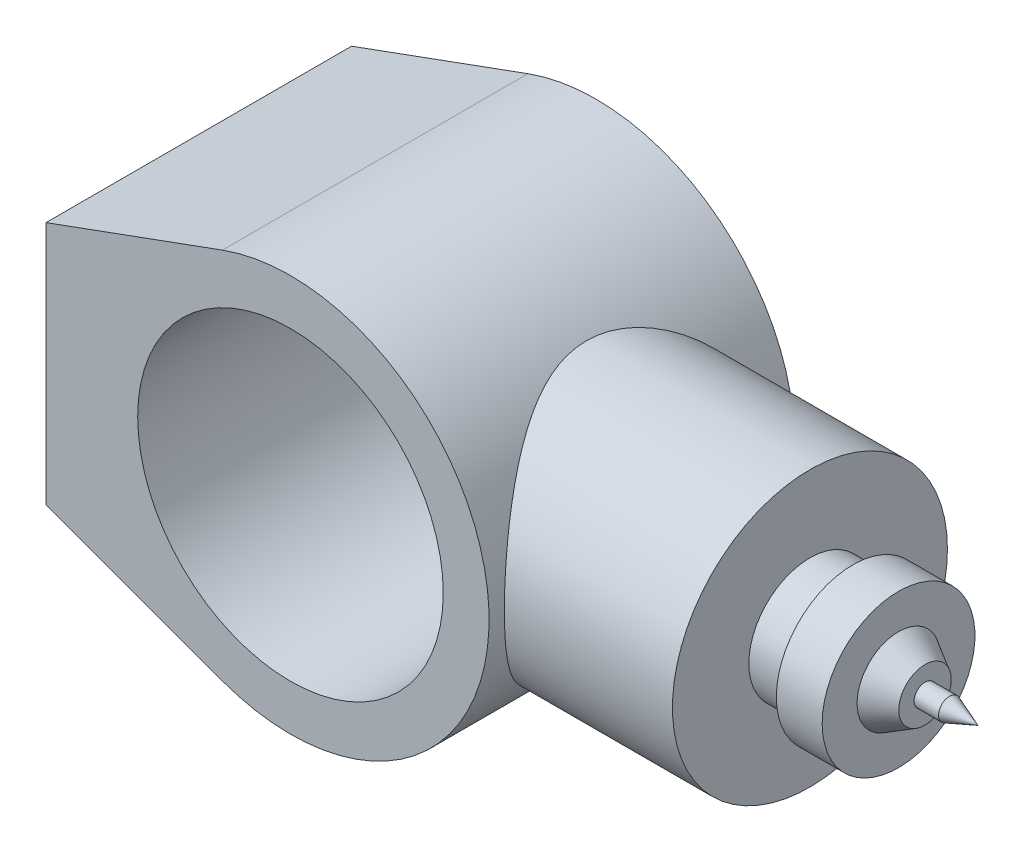
ISO-10303-21;
HEADER;
FILE_DESCRIPTION(('STEP AP214'),'2;1');
FILE_NAME('part.step','',(''),(''),'','','');
FILE_SCHEMA(('AUTOMOTIVE_DESIGN { 1 0 10303 214 1 1 1 1 }'));
ENDSEC;
DATA;
#1=APPLICATION_CONTEXT('core data for automotive mechanical design processes');
#2=APPLICATION_PROTOCOL_DEFINITION('international standard','automotive_design',2000,#1);
#3=PRODUCT_CONTEXT('',#1,'mechanical');
#4=PRODUCT('Part','Part','',(#3));
#5=PRODUCT_RELATED_PRODUCT_CATEGORY('part','',(#4));
#6=PRODUCT_DEFINITION_FORMATION('','',#4);
#7=PRODUCT_DEFINITION_CONTEXT('part definition',#1,'design');
#8=PRODUCT_DEFINITION('design','',#6,#7);
#9=PRODUCT_DEFINITION_SHAPE('','',#8);
#10=(LENGTH_UNIT() NAMED_UNIT(*) SI_UNIT(.MILLI.,.METRE.));
#11=(NAMED_UNIT(*) PLANE_ANGLE_UNIT() SI_UNIT($,.RADIAN.));
#12=(NAMED_UNIT(*) SI_UNIT($,.STERADIAN.) SOLID_ANGLE_UNIT());
#13=UNCERTAINTY_MEASURE_WITH_UNIT(LENGTH_MEASURE(1.E-05),#10,'distance_accuracy_value','');
#14=(GEOMETRIC_REPRESENTATION_CONTEXT(3) GLOBAL_UNCERTAINTY_ASSIGNED_CONTEXT((#13)) GLOBAL_UNIT_ASSIGNED_CONTEXT((#10,
#11,#12)) REPRESENTATION_CONTEXT('',''));
#15=CARTESIAN_POINT('',(0.,0.,0.));
#16=DIRECTION('',(0.,0.,1.));
#17=DIRECTION('',(1.,0.,0.));
#18=AXIS2_PLACEMENT_3D('',#15,#16,#17);
#19=CARTESIAN_POINT('',(0.,0.,50.));
#20=DIRECTION('',(0.,0.,1.));
#21=DIRECTION('',(1.,0.,0.));
#22=AXIS2_PLACEMENT_3D('',#19,#20,#21);
#23=PLANE('',#22);
#24=DIRECTION('',(-0.939410286372225,-0.342794856813887,0.));
#25=VECTOR('',#24,1.);
#26=CARTESIAN_POINT('',(-80.,40.,50.));
#27=LINE('',#26,#25);
#28=CARTESIAN_POINT('',(-22.2816656929027,61.0616686141947,50.));
#29=VERTEX_POINT('',#28);
#30=CARTESIAN_POINT('',(-80.,40.,50.));
#31=VERTEX_POINT('',#30);
#32=EDGE_CURVE('E202',#29,#31,#27,.T.);
#33=ORIENTED_EDGE('',*,*,#32,.T.);
#34=DIRECTION('',(0.,-1.,0.));
#35=VECTOR('',#34,1.);
#36=CARTESIAN_POINT('',(-80.,-40.,50.));
#37=LINE('',#36,#35);
#38=CARTESIAN_POINT('',(-80.,-40.,50.));
#39=VERTEX_POINT('',#38);
#40=EDGE_CURVE('E88',#31,#39,#37,.T.);
#41=ORIENTED_EDGE('',*,*,#40,.T.);
#42=DIRECTION('',(0.939410286372225,-0.342794856813887,0.));
#43=VECTOR('',#42,1.);
#44=CARTESIAN_POINT('',(-80.,-40.,50.));
#45=LINE('',#44,#43);
#46=CARTESIAN_POINT('',(-22.2816656929027,-61.0616686141947,50.));
#47=VERTEX_POINT('',#46);
#48=EDGE_CURVE('E195',#39,#47,#45,.T.);
#49=ORIENTED_EDGE('',*,*,#48,.T.);
#50=CARTESIAN_POINT('',(0.,0.,50.));
#51=DIRECTION('',(0.,0.,1.));
#52=DIRECTION('',(1.,0.,0.));
#53=AXIS2_PLACEMENT_3D('',#50,#51,#52);
#54=CIRCLE('',#53,65.);
#55=EDGE_CURVE('E57',#47,#29,#54,.T.);
#56=ORIENTED_EDGE('',*,*,#55,.T.);
#57=EDGE_LOOP('',(#33,#41,#49,#56));
#58=FACE_BOUND('',#57,.T.);
#59=CARTESIAN_POINT('',(0.,0.,50.));
#60=DIRECTION('',(0.,0.,1.));
#61=DIRECTION('',(1.,0.,0.));
#62=AXIS2_PLACEMENT_3D('',#59,#60,#61);
#63=CIRCLE('',#62,50.);
#64=CARTESIAN_POINT('',(50.,0.,50.));
#65=VERTEX_POINT('',#64);
#66=EDGE_CURVE('E217',#65,#65,#63,.T.);
#67=ORIENTED_EDGE('',*,*,#66,.F.);
#68=EDGE_LOOP('',(#67));
#69=FACE_BOUND('',#68,.T.);
#70=ADVANCED_FACE('F39',(#58,#69),#23,.T.);
#71=CARTESIAN_POINT('',(0.,0.,-50.));
#72=DIRECTION('',(0.,0.,1.));
#73=DIRECTION('',(1.,0.,0.));
#74=AXIS2_PLACEMENT_3D('',#71,#72,#73);
#75=PLANE('',#74);
#76=DIRECTION('',(-0.939410286372225,-0.342794856813887,0.));
#77=VECTOR('',#76,1.);
#78=CARTESIAN_POINT('',(-80.,40.,-50.));
#79=LINE('',#78,#77);
#80=CARTESIAN_POINT('',(-22.2816656929027,61.0616686141947,-50.));
#81=VERTEX_POINT('',#80);
#82=CARTESIAN_POINT('',(-80.,40.,-50.));
#83=VERTEX_POINT('',#82);
#84=EDGE_CURVE('E193',#81,#83,#79,.T.);
#85=ORIENTED_EDGE('',*,*,#84,.F.);
#86=CARTESIAN_POINT('',(0.,0.,-50.));
#87=DIRECTION('',(0.,0.,1.));
#88=DIRECTION('',(1.,0.,0.));
#89=AXIS2_PLACEMENT_3D('',#86,#87,#88);
#90=CIRCLE('',#89,65.);
#91=CARTESIAN_POINT('',(-22.2816656929027,-61.0616686141947,-50.));
#92=VERTEX_POINT('',#91);
#93=EDGE_CURVE('E81',#92,#81,#90,.T.);
#94=ORIENTED_EDGE('',*,*,#93,.F.);
#95=DIRECTION('',(0.939410286372225,-0.342794856813887,0.));
#96=VECTOR('',#95,1.);
#97=CARTESIAN_POINT('',(-80.,-40.,-50.));
#98=LINE('',#97,#96);
#99=CARTESIAN_POINT('',(-80.,-40.,-50.));
#100=VERTEX_POINT('',#99);
#101=EDGE_CURVE('E75',#100,#92,#98,.T.);
#102=ORIENTED_EDGE('',*,*,#101,.F.);
#103=DIRECTION('',(0.,-1.,0.));
#104=VECTOR('',#103,1.);
#105=CARTESIAN_POINT('',(-80.,-40.,-50.));
#106=LINE('',#105,#104);
#107=EDGE_CURVE('E187',#83,#100,#106,.T.);
#108=ORIENTED_EDGE('',*,*,#107,.F.);
#109=EDGE_LOOP('',(#85,#94,#102,#108));
#110=FACE_BOUND('',#109,.T.);
#111=CARTESIAN_POINT('',(0.,0.,-50.));
#112=DIRECTION('',(0.,0.,1.));
#113=DIRECTION('',(1.,0.,0.));
#114=AXIS2_PLACEMENT_3D('',#111,#112,#113);
#115=CIRCLE('',#114,50.);
#116=CARTESIAN_POINT('',(50.,0.,-50.));
#117=VERTEX_POINT('',#116);
#118=EDGE_CURVE('E220',#117,#117,#115,.T.);
#119=ORIENTED_EDGE('',*,*,#118,.T.);
#120=EDGE_LOOP('',(#119));
#121=FACE_BOUND('',#120,.T.);
#122=ADVANCED_FACE('F167',(#110,#121),#75,.F.);
#123=CARTESIAN_POINT('',(-80.,40.,50.));
#124=DIRECTION('',(0.342794856813887,-0.939410286372225,0.));
#125=DIRECTION('',(0.939410286372225,0.342794856813887,0.));
#126=AXIS2_PLACEMENT_3D('',#123,#124,#125);
#127=PLANE('',#126);
#128=ORIENTED_EDGE('',*,*,#84,.T.);
#129=DIRECTION('',(0.,0.,-1.));
#130=VECTOR('',#129,1.);
#131=CARTESIAN_POINT('',(-80.,40.,50.));
#132=LINE('',#131,#130);
#133=EDGE_CURVE('E11',#31,#83,#132,.T.);
#134=ORIENTED_EDGE('',*,*,#133,.F.);
#135=ORIENTED_EDGE('',*,*,#32,.F.);
#136=DIRECTION('',(0.,0.,-1.));
#137=VECTOR('',#136,1.);
#138=CARTESIAN_POINT('',(-22.2816656929027,61.0616686141947,50.));
#139=LINE('',#138,#137);
#140=EDGE_CURVE('E206',#29,#81,#139,.T.);
#141=ORIENTED_EDGE('',*,*,#140,.T.);
#142=EDGE_LOOP('',(#128,#134,#135,#141));
#143=FACE_BOUND('',#142,.T.);
#144=ADVANCED_FACE('F41',(#143),#127,.F.);
#145=CARTESIAN_POINT('',(-80.,-40.,50.));
#146=DIRECTION('',(1.,0.,0.));
#147=DIRECTION('',(0.,0.,-1.));
#148=AXIS2_PLACEMENT_3D('',#145,#146,#147);
#149=PLANE('',#148);
#150=ORIENTED_EDGE('',*,*,#107,.T.);
#151=DIRECTION('',(0.,0.,-1.));
#152=VECTOR('',#151,1.);
#153=CARTESIAN_POINT('',(-80.,-40.,50.));
#154=LINE('',#153,#152);
#155=EDGE_CURVE('E49',#39,#100,#154,.T.);
#156=ORIENTED_EDGE('',*,*,#155,.F.);
#157=ORIENTED_EDGE('',*,*,#40,.F.);
#158=ORIENTED_EDGE('',*,*,#133,.T.);
#159=EDGE_LOOP('',(#150,#156,#157,#158));
#160=FACE_BOUND('',#159,.T.);
#161=ADVANCED_FACE('F181',(#160),#149,.F.);
#162=CARTESIAN_POINT('',(-80.,-40.,50.));
#163=DIRECTION('',(0.342794856813887,0.939410286372225,0.));
#164=DIRECTION('',(-0.939410286372225,0.342794856813887,0.));
#165=AXIS2_PLACEMENT_3D('',#162,#163,#164);
#166=PLANE('',#165);
#167=ORIENTED_EDGE('',*,*,#101,.T.);
#168=DIRECTION('',(0.,0.,-1.));
#169=VECTOR('',#168,1.);
#170=CARTESIAN_POINT('',(-22.2816656929027,-61.0616686141947,50.));
#171=LINE('',#170,#169);
#172=EDGE_CURVE('E197',#47,#92,#171,.T.);
#173=ORIENTED_EDGE('',*,*,#172,.F.);
#174=ORIENTED_EDGE('',*,*,#48,.F.);
#175=ORIENTED_EDGE('',*,*,#155,.T.);
#176=EDGE_LOOP('',(#167,#173,#174,#175));
#177=FACE_BOUND('',#176,.T.);
#178=ADVANCED_FACE('F178',(#177),#166,.F.);
#179=CARTESIAN_POINT('',(0.,0.,50.));
#180=DIRECTION('',(0.,0.,-1.));
#181=DIRECTION('',(-1.,0.,0.));
#182=AXIS2_PLACEMENT_3D('',#179,#180,#181);
#183=CYLINDRICAL_SURFACE('',#182,65.);
#184=CARTESIAN_POINT('',(65.,0.,-45.));
#185=CARTESIAN_POINT('',(65.0000011696057,1.12147330120565,-45.0000012025283));
#186=CARTESIAN_POINT('',(64.9709159765212,2.24292945230778,-44.9580201602482));
#187=CARTESIAN_POINT('',(64.8553068641383,4.47658414079082,-44.790785609369));
#188=CARTESIAN_POINT('',(64.7687842573088,5.58878288911931,-44.6655340035371));
#189=CARTESIAN_POINT('',(64.5403785763001,7.79555151848628,-44.3336771879691));
#190=CARTESIAN_POINT('',(64.3984760503456,8.89011506447751,-44.1270433931238));
#191=CARTESIAN_POINT('',(64.0626457436966,11.0533096019768,-43.6354760134034));
#192=CARTESIAN_POINT('',(63.8687169569864,12.1219400915896,-43.3505409144375));
#193=CARTESIAN_POINT('',(63.4342222744662,14.2212125160505,-42.7078017297046));
#194=CARTESIAN_POINT('',(63.1938918545645,15.2520162370063,-42.3503651251477));
#195=CARTESIAN_POINT('',(62.6709259446924,17.2756280115286,-41.5659763086892));
#196=CARTESIAN_POINT('',(62.3882907364915,18.268436318107,-41.1390245597888));
#197=CARTESIAN_POINT('',(61.786108553932,20.2116697228795,-40.2199419970838));
#198=CARTESIAN_POINT('',(61.4665619062631,21.1620951960855,-39.7278117601444));
#199=CARTESIAN_POINT('',(60.7962171584065,23.0172309124314,-38.6825647509799));
#200=CARTESIAN_POINT('',(60.4454175300334,23.9219389167185,-38.1294449962195));
#201=CARTESIAN_POINT('',(59.6865648974474,25.7601880140228,-36.9151737617935));
#202=CARTESIAN_POINT('',(59.27618815402,26.6893215363404,-36.2488040005491));
#203=CARTESIAN_POINT('',(58.4330275057249,28.4880338622967,-34.8529502059224));
#204=CARTESIAN_POINT('',(58.0002425478181,29.3576098626539,-34.1234632053608));
#205=CARTESIAN_POINT('',(57.1195111836477,31.0364486388513,-32.6040251352403));
#206=CARTESIAN_POINT('',(56.6715447181891,31.8456267033451,-31.8139921794123));
#207=CARTESIAN_POINT('',(55.7691986061138,33.4006700551814,-30.1773036556993));
#208=CARTESIAN_POINT('',(55.3148185876119,34.1465316534289,-29.3306447936721));
#209=CARTESIAN_POINT('',(54.3303114345595,35.6959084068904,-27.4326466159468));
#210=CARTESIAN_POINT('',(53.8005937511269,36.4872853280241,-26.3711450656527));
#211=CARTESIAN_POINT('',(52.7593327891933,37.9773509509911,-24.17604025639));
#212=CARTESIAN_POINT('',(52.2477941160227,38.6760162868262,-23.0424189272517));
#213=CARTESIAN_POINT('',(51.2608149265043,39.9749077721744,-20.7072341856928));
#214=CARTESIAN_POINT('',(50.7853275075273,40.5752630453964,-19.5057627267967));
#215=CARTESIAN_POINT('',(49.8892399163793,41.6721166930025,-17.036931864064));
#216=CARTESIAN_POINT('',(49.4686114171658,42.1686687478853,-15.7696069409943));
#217=CARTESIAN_POINT('',(48.8208029416879,42.9149535309565,-13.5723996352816));
#218=CARTESIAN_POINT('',(48.5738420263557,43.1936925213245,-12.6581208440976));
#219=CARTESIAN_POINT('',(48.1238801744123,43.6944569649788,-10.8035389223551));
#220=CARTESIAN_POINT('',(47.9208721021929,43.9164916250901,-9.86324004407419));
#221=CARTESIAN_POINT('',(47.5660754926548,44.3005296261305,-7.96250438663409));
#222=CARTESIAN_POINT('',(47.4142038087044,44.4626304606427,-7.00210302149487));
#223=CARTESIAN_POINT('',(47.1671263845177,44.7246555122386,-5.06554052628518));
#224=CARTESIAN_POINT('',(47.0719206259529,44.824579749433,-4.08937940131224));
#225=CARTESIAN_POINT('',(46.9418899090943,44.9607388198673,-2.1232364847967));
#226=CARTESIAN_POINT('',(46.9073939345417,44.9966266570423,-1.13320851844658));
#227=CARTESIAN_POINT('',(46.9013571135476,45.0029190462422,0.847248377093852));
#228=CARTESIAN_POINT('',(46.9298161498631,44.9733237202183,1.837677305534));
#229=CARTESIAN_POINT('',(47.0484302849821,44.8492190899201,3.81128752429081));
#230=CARTESIAN_POINT('',(47.13862305521,44.7546701492421,4.79446401850661));
#231=CARTESIAN_POINT('',(47.3768313176079,44.5024241630868,6.74551496467455));
#232=CARTESIAN_POINT('',(47.5248480621437,44.3447257499009,7.71338908473168));
#233=CARTESIAN_POINT('',(47.8621764271841,43.9803320764262,9.56919366964684));
#234=CARTESIAN_POINT('',(48.0484149088864,43.7772163066585,10.4583970625519));
#235=CARTESIAN_POINT('',(48.4609441046406,43.32010640119,12.2144143492181));
#236=CARTESIAN_POINT('',(48.6872496045115,43.0660934784815,13.0812198417583));
#237=CARTESIAN_POINT('',(49.1738509640383,42.5096331932465,14.7898225666927));
#238=CARTESIAN_POINT('',(49.4341648638834,42.2071601049958,15.6316062329481));
#239=CARTESIAN_POINT('',(49.9825182796335,41.5563350032134,17.2876417419013));
#240=CARTESIAN_POINT('',(50.2705534011697,41.2079902580444,18.1018979206949));
#241=CARTESIAN_POINT('',(51.0225431471345,40.2767822129268,20.1137766396802));
#242=CARTESIAN_POINT('',(51.5007434523328,39.6654891440572,21.2930273345177));
#243=CARTESIAN_POINT('',(52.4891158781477,38.348029920852,23.5833678403921));
#244=CARTESIAN_POINT('',(52.9993005340589,37.6418264436726,24.6944305853524));
#245=CARTESIAN_POINT('',(54.0361557973494,36.1376496350166,26.8476775780095));
#246=CARTESIAN_POINT('',(54.5628535785461,35.3395185623559,27.8897384505711));
#247=CARTESIAN_POINT('',(55.6171804467178,33.6558443419671,29.8998791095632));
#248=CARTESIAN_POINT('',(56.1448094104418,32.7703120184234,30.8679680307498));
#249=CARTESIAN_POINT('',(57.1932449701135,30.9045304086319,32.7363921475659));
#250=CARTESIAN_POINT('',(57.7139191350983,29.9233731295192,33.6358963165067));
#251=CARTESIAN_POINT('',(58.7296419536465,27.8771206485979,35.350355349792));
#252=CARTESIAN_POINT('',(59.2246882700661,26.8120178135979,36.1653025097018));
#253=CARTESIAN_POINT('',(60.1756566955639,24.6035209522421,37.7024332048813));
#254=CARTESIAN_POINT('',(60.6316475651595,23.4602711709794,38.4247809320632));
#255=CARTESIAN_POINT('',(61.4931891608211,21.0989507187335,39.7703323765769));
#256=CARTESIAN_POINT('',(61.898755017873,19.8809026570889,40.3935658507715));
#257=CARTESIAN_POINT('',(62.5646802947783,17.6549035875762,41.4059204565395));
#258=CARTESIAN_POINT('',(62.8372982548467,16.6602403417733,41.8163120535009));
#259=CARTESIAN_POINT('',(63.3397164077328,14.6345031625144,42.5675669112335));
#260=CARTESIAN_POINT('',(63.569522535998,13.603434299959,42.9084398107234));
#261=CARTESIAN_POINT('',(63.9815049902596,11.5110112910016,43.5164676119118));
#262=CARTESIAN_POINT('',(64.1637052650743,10.4496726714621,43.7836595836378));
#263=CARTESIAN_POINT('',(64.476639865795,8.30296993183371,44.2409869387356));
#264=CARTESIAN_POINT('',(64.6073730982257,7.21760530180254,44.431120684921));
#265=CARTESIAN_POINT('',(64.8147345736682,5.02649787175023,44.7321113931983));
#266=CARTESIAN_POINT('',(64.8911534961694,3.92069290489763,44.8426616714377));
#267=CARTESIAN_POINT('',(64.9872183357685,1.70145350776208,44.981563734156));
#268=CARTESIAN_POINT('',(65.0068642771874,0.588019080747696,45.0099155538474));
#269=CARTESIAN_POINT('',(64.9889001241945,-1.63741781931566,44.9839662509349));
#270=CARTESIAN_POINT('',(64.9512898349751,-2.74942028747967,44.929664847113));
#271=CARTESIAN_POINT('',(64.819734418053,-4.96298947367603,44.7392747901952));
#272=CARTESIAN_POINT('',(64.7257910494465,-6.06455651648127,44.6031886909653));
#273=CARTESIAN_POINT('',(64.491175703309,-8.18254449212149,44.2620157992034));
#274=CARTESIAN_POINT('',(64.3536808680178,-9.20007959997774,44.0616107864454));
#275=CARTESIAN_POINT('',(64.0337856060908,-11.2121337136589,43.5930613516679));
#276=CARTESIAN_POINT('',(63.8513873855499,-12.2066538475799,43.3249202574929));
#277=CARTESIAN_POINT('',(63.4451725249075,-14.1673074608523,42.7239854011605));
#278=CARTESIAN_POINT('',(63.2213525684632,-15.1334386601223,42.3911864622047));
#279=CARTESIAN_POINT('',(62.736336352677,-17.0327019487273,41.6643868113868));
#280=CARTESIAN_POINT('',(62.4751380044848,-17.965832190203,41.2703826790343));
#281=CARTESIAN_POINT('',(61.8990085085122,-19.8637431772395,40.3931275129008));
#282=CARTESIAN_POINT('',(61.5815209528501,-20.8256806929253,39.9054081529014));
#283=CARTESIAN_POINT('',(60.9142086391395,-22.7035764997345,38.8677076181211));
#284=CARTESIAN_POINT('',(60.5643826081083,-23.6195329786528,38.3177239921568));
#285=CARTESIAN_POINT('',(59.8381347129401,-25.4032558353403,37.1592008079418));
#286=CARTESIAN_POINT('',(59.4616987975441,-26.270996314329,36.5506302507532));
#287=CARTESIAN_POINT('',(58.6884577670336,-27.9557544991496,35.2787474176625));
#288=CARTESIAN_POINT('',(58.2916515549571,-28.7727694681138,34.6154321925309));
#289=CARTESIAN_POINT('',(57.4151711853793,-30.4889708749912,33.1199200847161));
#290=CARTESIAN_POINT('',(56.9328754552547,-31.3785212006928,32.2781812569548));
#291=CARTESIAN_POINT('',(55.9590893109094,-33.0839042215169,30.5278352445589));
#292=CARTESIAN_POINT('',(55.4675975421249,-33.8997259516808,29.6192181500899));
#293=CARTESIAN_POINT('',(54.4860350387397,-35.45586994741,27.7375714933993));
#294=CARTESIAN_POINT('',(53.9959654596117,-36.1961418986443,26.7644997080007));
#295=CARTESIAN_POINT('',(53.0294834997435,-37.5978502361011,24.7568233036382));
#296=CARTESIAN_POINT('',(52.553069328415,-38.2592969946585,23.7222268074148));
#297=CARTESIAN_POINT('',(51.679941347726,-39.4291013564639,21.7149007388747));
#298=CARTESIAN_POINT('',(51.2803372484816,-39.9463152685162,20.7485884228094));
#299=CARTESIAN_POINT('',(50.5123974548912,-40.9130636661729,18.7705314851885));
#300=CARTESIAN_POINT('',(50.1440619804653,-41.3625976757848,17.7587865441704));
#301=CARTESIAN_POINT('',(49.4504928922364,-42.1893301292689,15.693797265063));
#302=CARTESIAN_POINT('',(49.1251906412473,-42.566644202947,14.6406225749502));
#303=CARTESIAN_POINT('',(48.5290098021012,-43.2451098617227,12.4950157035289));
#304=CARTESIAN_POINT('',(48.2581179989952,-43.5462799449171,11.4025931307277));
#305=CARTESIAN_POINT('',(47.8271610412375,-44.0186874861181,9.3921629994351));
#306=CARTESIAN_POINT('',(47.6558419905218,-44.2036946073207,8.47979353570419));
#307=CARTESIAN_POINT('',(47.3627606953031,-44.517583244497,6.63757582668245));
#308=CARTESIAN_POINT('',(47.2409923142224,-44.6464717105955,5.70772976070373));
#309=CARTESIAN_POINT('',(47.05166615705,-44.8459556683364,3.83718735816971));
#310=CARTESIAN_POINT('',(46.9840561376509,-44.9166073394187,2.89650236820514));
#311=CARTESIAN_POINT('',(46.9055698265682,-44.9985645522097,1.01014116515035));
#312=CARTESIAN_POINT('',(46.894694331428,-45.0098692606967,0.0644648821697862));
#313=CARTESIAN_POINT('',(46.9301408777119,-44.972908524549,-1.82506201386804));
#314=CARTESIAN_POINT('',(46.9764888551696,-44.9246160680299,-2.76891160474201));
#315=CARTESIAN_POINT('',(47.1245232303033,-44.7693052695385,-4.64731891289862));
#316=CARTESIAN_POINT('',(47.226209296244,-44.6622872796082,-5.58187668584874));
#317=CARTESIAN_POINT('',(47.4811423262629,-44.3911660407895,-7.43666598606561));
#318=CARTESIAN_POINT('',(47.634452919394,-44.2269923369625,-8.35687836049678));
#319=CARTESIAN_POINT('',(47.9871889035597,-43.8440109221367,-10.1768310643423));
#320=CARTESIAN_POINT('',(48.1866204648689,-43.6251959006593,-11.0765686368372));
#321=CARTESIAN_POINT('',(48.6908782922366,-43.0625185245671,-13.116726178063));
#322=CARTESIAN_POINT('',(49.0093972350599,-42.7008255731353,-14.2488681052183));
#323=CARTESIAN_POINT('',(49.699554494161,-41.8955268796886,-16.4668795226373));
#324=CARTESIAN_POINT('',(50.0712093704162,-41.4518955887103,-17.5527344499461));
#325=CARTESIAN_POINT('',(50.8544123719762,-40.4872212981013,-19.6760329984318));
#326=CARTESIAN_POINT('',(51.2660067549033,-39.9660881554129,-20.7134183727638));
#327=CARTESIAN_POINT('',(52.116211879306,-38.8508952329155,-22.7363587217865));
#328=CARTESIAN_POINT('',(52.5548209260535,-38.2568400254561,-23.7219169406072));
#329=CARTESIAN_POINT('',(53.4579357785502,-36.9847423381263,-25.6613286822633));
#330=CARTESIAN_POINT('',(53.9228021101371,-36.3051118639051,-26.6139712103077));
#331=CARTESIAN_POINT('',(54.8583333343946,-34.8753950985048,-28.4617532840731));
#332=CARTESIAN_POINT('',(55.3289982185488,-34.1253089107936,-29.3568929142368));
#333=CARTESIAN_POINT('',(56.2664339133503,-32.5564691651912,-31.0876310121466));
#334=CARTESIAN_POINT('',(56.7332035093429,-31.7376950080829,-31.923211478402));
#335=CARTESIAN_POINT('',(57.6535165855435,-30.033481652025,-33.5315189390535));
#336=CARTESIAN_POINT('',(58.1070588196762,-29.1480362003111,-34.3042400240121));
#337=CARTESIAN_POINT('',(59.0635284336244,-27.1643113596245,-35.9022819462667));
#338=CARTESIAN_POINT('',(59.5626106290919,-26.0547472869609,-36.7159606163356));
#339=CARTESIAN_POINT('',(60.5176757229357,-23.7521280348398,-38.2458641369291));
#340=CARTESIAN_POINT('',(60.9736519283074,-22.5590599397198,-38.962073861155));
#341=CARTESIAN_POINT('',(61.6149926579414,-20.7127348127311,-39.9558623322098));
#342=CARTESIAN_POINT('',(61.8215919655179,-20.088110583999,-40.2735888165198));
#343=CARTESIAN_POINT('',(62.2191547005856,-18.8206694867556,-40.8812436548858));
#344=CARTESIAN_POINT('',(62.4101203779565,-18.1778552539997,-41.1711760099034));
#345=CARTESIAN_POINT('',(62.7748527233683,-16.875283117665,-41.7219931318356));
#346=CARTESIAN_POINT('',(62.9486230408552,-16.2155288469421,-41.9828840638124));
#347=CARTESIAN_POINT('',(63.2775356475737,-14.8804011558233,-42.4744610119283));
#348=CARTESIAN_POINT('',(63.432679284421,-14.2050288695917,-42.7051492133046));
#349=CARTESIAN_POINT('',(63.8070721968101,-12.4447010544915,-43.25974494481));
#350=CARTESIAN_POINT('',(64.0114184468014,-11.3490405228654,-43.5602757498286));
#351=CARTESIAN_POINT('',(64.3654191982087,-9.12991345978806,-44.078827644396));
#352=CARTESIAN_POINT('',(64.5150820049425,-8.00645117856259,-44.2968612637911));
#353=CARTESIAN_POINT('',(64.7559993187061,-5.74082253729113,-44.6470112993716));
#354=CARTESIAN_POINT('',(64.847297757104,-4.59867091062173,-44.7791923387443));
#355=CARTESIAN_POINT('',(64.9692976296881,-2.30434018473195,-44.9556862638234));
#356=CARTESIAN_POINT('',(64.9999987983895,-1.15216104160189,-44.999998764566));
#357=CARTESIAN_POINT('',(65.,0.,-45.));
#358=B_SPLINE_CURVE_WITH_KNOTS('',3,(#184,#185,#186,#187,#188,#189,#190,#191,#192,#193,#194,
#195,#196,#197,#198,#199,#200,#201,#202,#203,#204,#205,#206,#207,#208,#209,#210,#211,#212,#213,
#214,#215,#216,#217,#218,#219,#220,#221,#222,#223,#224,#225,#226,#227,#228,#229,#230,#231,#232,
#233,#234,#235,#236,#237,#238,#239,#240,#241,#242,#243,#244,#245,#246,#247,#248,#249,#250,#251,
#252,#253,#254,#255,#256,#257,#258,#259,#260,#261,#262,#263,#264,#265,#266,#267,#268,#269,#270,
#271,#272,#273,#274,#275,#276,#277,#278,#279,#280,#281,#282,#283,#284,#285,#286,#287,#288,#289,
#290,#291,#292,#293,#294,#295,#296,#297,#298,#299,#300,#301,#302,#303,#304,#305,#306,#307,#308,
#309,#310,#311,#312,#313,#314,#315,#316,#317,#318,#319,#320,#321,#322,#323,#324,#325,#326,#327,
#328,#329,#330,#331,#332,#333,#334,#335,#336,#337,#338,#339,#340,#341,#342,#343,#344,#345,#346,
#347,#348,#349,#350,#351,#352,#353,#354,#355,#356,#357),.UNSPECIFIED.,.T.,.F.,(4,2,2,2,2,2,2,2,
2,2,2,2,2,2,2,2,2,2,2,2,2,2,2,2,2,2,2,2,2,2,2,2,2,2,2,2,2,2,2,2,2,2,2,2,2,2,2,2,2,2,2,2,2,2,2,2,
2,2,2,2,2,2,2,2,2,2,2,2,2,2,2,2,2,2,2,2,2,2,2,2,2,2,2,2,2,2,4),(0.,3.36323892794144,
6.72640100710137,10.0907454360665,13.4551549250109,16.8029195613731,20.1506619010729,
23.4983746134034,26.8462511096753,30.4871649037346,34.1282499524345,37.7743494260164,
41.4206611917409,45.6939383064405,49.9682903731881,54.2369825353392,58.5034617073671,
61.4625138492405,64.4210852373372,67.3748225577202,70.3285589227263,73.2982527376573,
76.2679410220407,79.2394430998938,82.2110095388412,85.0011411726389,87.7923045951578,
90.584954683776,93.3771628083065,97.6064034875675,101.837312178738,106.075592113262,
110.313347816192,114.596218662803,118.879479402292,123.155037051935,127.429308626693,
130.755998382163,134.082226580387,137.406778235214,140.731400520075,144.068767009318,
147.406132068879,150.743508483461,154.080780688207,157.215791533369,160.350648386749,
163.485756334407,166.621039552604,169.990545063149,173.360183268584,176.73161428665,
180.103227050672,184.047902440152,187.993163521895,191.94103513809,195.888386692538,
199.385185586645,202.88200907258,206.373186157811,209.863514294626,212.700365177753,
215.536864625513,218.370624567028,221.204424293963,224.039508887241,226.874576485218,
229.713151272815,232.55210603787,236.23803941247,239.925124033801,243.616531168718,
247.307706963636,251.081871120678,254.856029735252,258.631324277359,262.406973327354,
266.792058434818,271.177823293658,273.368885604935,275.55963203795,277.749912517597,
279.940034437727,283.398420446896,286.856280978073,290.31153567335,293.766805506531),.UNSPECIFIED.);
#359=CARTESIAN_POINT('',(65.,0.,-45.));
#360=VERTEX_POINT('',#359);
#361=EDGE_CURVE('E132',#360,#360,#358,.T.);
#362=ORIENTED_EDGE('',*,*,#361,.F.);
#363=EDGE_LOOP('',(#362));
#364=FACE_BOUND('',#363,.T.);
#365=ORIENTED_EDGE('',*,*,#93,.T.);
#366=ORIENTED_EDGE('',*,*,#140,.F.);
#367=ORIENTED_EDGE('',*,*,#55,.F.);
#368=ORIENTED_EDGE('',*,*,#172,.T.);
#369=EDGE_LOOP('',(#365,#366,#367,#368));
#370=FACE_BOUND('',#369,.T.);
#371=ADVANCED_FACE('F164',(#364,#370),#183,.T.);
#372=CARTESIAN_POINT('',(0.,0.,50.));
#373=DIRECTION('',(0.,0.,-1.));
#374=DIRECTION('',(-1.,0.,0.));
#375=AXIS2_PLACEMENT_3D('',#372,#373,#374);
#376=CYLINDRICAL_SURFACE('',#375,50.);
#377=ORIENTED_EDGE('',*,*,#66,.T.);
#378=EDGE_LOOP('',(#377));
#379=FACE_BOUND('',#378,.T.);
#380=ORIENTED_EDGE('',*,*,#118,.F.);
#381=EDGE_LOOP('',(#380));
#382=FACE_BOUND('',#381,.T.);
#383=ADVANCED_FACE('F154',(#379,#382),#376,.F.);
#384=CARTESIAN_POINT('',(-80.002,0.,0.));
#385=DIRECTION('',(1.,0.,0.));
#386=DIRECTION('',(0.,0.,-1.));
#387=AXIS2_PLACEMENT_3D('',#384,#385,#386);
#388=CYLINDRICAL_SURFACE('',#387,45.);
#389=CARTESIAN_POINT('',(120.,0.,0.));
#390=DIRECTION('',(1.,0.,0.));
#391=DIRECTION('',(0.,0.,-1.));
#392=AXIS2_PLACEMENT_3D('',#389,#390,#391);
#393=CIRCLE('',#392,45.);
#394=CARTESIAN_POINT('',(120.,0.,-45.));
#395=VERTEX_POINT('',#394);
#396=EDGE_CURVE('E141',#395,#395,#393,.T.);
#397=ORIENTED_EDGE('',*,*,#396,.F.);
#398=EDGE_LOOP('',(#397));
#399=FACE_BOUND('',#398,.T.);
#400=ORIENTED_EDGE('',*,*,#361,.T.);
#401=EDGE_LOOP('',(#400));
#402=FACE_BOUND('',#401,.T.);
#403=ADVANCED_FACE('F143',(#399,#402),#388,.T.);
#404=CARTESIAN_POINT('',(120.,0.,0.));
#405=DIRECTION('',(1.,0.,0.));
#406=DIRECTION('',(0.,0.,-1.));
#407=AXIS2_PLACEMENT_3D('',#404,#405,#406);
#408=PLANE('',#407);
#409=CARTESIAN_POINT('',(120.,0.,0.));
#410=DIRECTION('',(-1.,0.,0.));
#411=DIRECTION('',(0.,0.,1.));
#412=AXIS2_PLACEMENT_3D('',#409,#410,#411);
#413=CIRCLE('',#412,20.);
#414=CARTESIAN_POINT('',(120.,0.,20.));
#415=VERTEX_POINT('',#414);
#416=EDGE_CURVE('E128',#415,#415,#413,.T.);
#417=ORIENTED_EDGE('',*,*,#416,.T.);
#418=EDGE_LOOP('',(#417));
#419=FACE_BOUND('',#418,.T.);
#420=ORIENTED_EDGE('',*,*,#396,.T.);
#421=EDGE_LOOP('',(#420));
#422=FACE_BOUND('',#421,.T.);
#423=ADVANCED_FACE('F151',(#419,#422),#408,.T.);
#424=CARTESIAN_POINT('',(0.,0.,0.));
#425=DIRECTION('',(-1.,0.,0.));
#426=DIRECTION('',(0.,0.,1.));
#427=AXIS2_PLACEMENT_3D('',#424,#425,#426);
#428=CYLINDRICAL_SURFACE('',#427,20.);
#429=CARTESIAN_POINT('',(134.,0.,0.));
#430=DIRECTION('',(-1.,0.,0.));
#431=DIRECTION('',(0.,0.,1.));
#432=AXIS2_PLACEMENT_3D('',#429,#430,#431);
#433=CIRCLE('',#432,20.);
#434=CARTESIAN_POINT('',(134.,0.,20.));
#435=VERTEX_POINT('',#434);
#436=EDGE_CURVE('E124',#435,#435,#433,.T.);
#437=ORIENTED_EDGE('',*,*,#436,.T.);
#438=EDGE_LOOP('',(#437));
#439=FACE_BOUND('',#438,.T.);
#440=ORIENTED_EDGE('',*,*,#416,.F.);
#441=EDGE_LOOP('',(#440));
#442=FACE_BOUND('',#441,.T.);
#443=ADVANCED_FACE('F149',(#439,#442),#428,.T.);
#444=CARTESIAN_POINT('',(134.,-20.,0.));
#445=DIRECTION('',(-1.,0.,0.));
#446=DIRECTION('',(0.,0.,1.));
#447=AXIS2_PLACEMENT_3D('',#444,#445,#446);
#448=PLANE('',#447);
#449=CARTESIAN_POINT('',(134.,0.,0.));
#450=DIRECTION('',(-1.,0.,0.));
#451=DIRECTION('',(0.,0.,1.));
#452=AXIS2_PLACEMENT_3D('',#449,#450,#451);
#453=CIRCLE('',#452,25.);
#454=CARTESIAN_POINT('',(134.,0.,25.));
#455=VERTEX_POINT('',#454);
#456=EDGE_CURVE('E120',#455,#455,#453,.T.);
#457=ORIENTED_EDGE('',*,*,#456,.T.);
#458=EDGE_LOOP('',(#457));
#459=FACE_BOUND('',#458,.T.);
#460=ORIENTED_EDGE('',*,*,#436,.F.);
#461=EDGE_LOOP('',(#460));
#462=FACE_BOUND('',#461,.T.);
#463=ADVANCED_FACE('F159',(#459,#462),#448,.T.);
#464=CARTESIAN_POINT('',(0.,0.,0.));
#465=DIRECTION('',(-1.,0.,0.));
#466=DIRECTION('',(0.,0.,1.));
#467=AXIS2_PLACEMENT_3D('',#464,#465,#466);
#468=CYLINDRICAL_SURFACE('',#467,25.);
#469=CARTESIAN_POINT('',(149.,0.,0.));
#470=DIRECTION('',(-1.,0.,0.));
#471=DIRECTION('',(0.,0.,1.));
#472=AXIS2_PLACEMENT_3D('',#469,#470,#471);
#473=CIRCLE('',#472,25.);
#474=CARTESIAN_POINT('',(149.,0.,25.));
#475=VERTEX_POINT('',#474);
#476=EDGE_CURVE('E116',#475,#475,#473,.T.);
#477=ORIENTED_EDGE('',*,*,#476,.T.);
#478=EDGE_LOOP('',(#477));
#479=FACE_BOUND('',#478,.T.);
#480=ORIENTED_EDGE('',*,*,#456,.F.);
#481=EDGE_LOOP('',(#480));
#482=FACE_BOUND('',#481,.T.);
#483=ADVANCED_FACE('F290',(#479,#482),#468,.T.);
#484=CARTESIAN_POINT('',(149.,-25.,0.));
#485=DIRECTION('',(1.,0.,0.));
#486=DIRECTION('',(0.,0.,-1.));
#487=AXIS2_PLACEMENT_3D('',#484,#485,#486);
#488=PLANE('',#487);
#489=CARTESIAN_POINT('',(149.,0.,0.));
#490=DIRECTION('',(-1.,0.,0.));
#491=DIRECTION('',(0.,0.,1.));
#492=AXIS2_PLACEMENT_3D('',#489,#490,#491);
#493=CIRCLE('',#492,13.5733940955901);
#494=CARTESIAN_POINT('',(149.,0.,13.5733940955901));
#495=VERTEX_POINT('',#494);
#496=EDGE_CURVE('E112',#495,#495,#493,.T.);
#497=ORIENTED_EDGE('',*,*,#496,.T.);
#498=EDGE_LOOP('',(#497));
#499=FACE_BOUND('',#498,.T.);
#500=ORIENTED_EDGE('',*,*,#476,.F.);
#501=EDGE_LOOP('',(#500));
#502=FACE_BOUND('',#501,.T.);
#503=ADVANCED_FACE('F298',(#499,#502),#488,.T.);
#504=CARTESIAN_POINT('',(149.,0.,0.));
#505=DIRECTION('',(-1.,0.,0.));
#506=DIRECTION('',(0.,0.,1.));
#507=AXIS2_PLACEMENT_3D('',#504,#505,#506);
#508=CONICAL_SURFACE('',#507,13.5733940955901,0.523598775598299);
#509=CARTESIAN_POINT('',(157.660254037844,0.,0.));
#510=DIRECTION('',(-1.,0.,0.));
#511=DIRECTION('',(0.,0.,1.));
#512=AXIS2_PLACEMENT_3D('',#509,#510,#511);
#513=CIRCLE('',#512,8.57339409559013);
#514=CARTESIAN_POINT('',(157.660254037844,0.,8.57339409559013));
#515=VERTEX_POINT('',#514);
#516=EDGE_CURVE('E106',#515,#515,#513,.T.);
#517=ORIENTED_EDGE('',*,*,#516,.T.);
#518=EDGE_LOOP('',(#517));
#519=FACE_BOUND('',#518,.T.);
#520=ORIENTED_EDGE('',*,*,#496,.F.);
#521=EDGE_LOOP('',(#520));
#522=FACE_BOUND('',#521,.T.);
#523=ADVANCED_FACE('F307',(#519,#522),#508,.T.);
#524=CARTESIAN_POINT('',(157.660254037844,-8.57339409559013,0.));
#525=DIRECTION('',(1.,0.,0.));
#526=DIRECTION('',(0.,0.,-1.));
#527=AXIS2_PLACEMENT_3D('',#524,#525,#526);
#528=PLANE('',#527);
#529=CARTESIAN_POINT('',(157.660254037844,0.,0.));
#530=DIRECTION('',(-1.,0.,0.));
#531=DIRECTION('',(0.,0.,1.));
#532=AXIS2_PLACEMENT_3D('',#529,#530,#531);
#533=CIRCLE('',#532,3.57339409559013);
#534=CARTESIAN_POINT('',(157.660254037844,0.,3.57339409559013));
#535=VERTEX_POINT('',#534);
#536=EDGE_CURVE('E102',#535,#535,#533,.T.);
#537=ORIENTED_EDGE('',*,*,#536,.T.);
#538=EDGE_LOOP('',(#537));
#539=FACE_BOUND('',#538,.T.);
#540=ORIENTED_EDGE('',*,*,#516,.F.);
#541=EDGE_LOOP('',(#540));
#542=FACE_BOUND('',#541,.T.);
#543=ADVANCED_FACE('F316',(#539,#542),#528,.T.);
#544=CARTESIAN_POINT('',(0.,0.,0.));
#545=DIRECTION('',(-1.,0.,0.));
#546=DIRECTION('',(0.,0.,1.));
#547=AXIS2_PLACEMENT_3D('',#544,#545,#546);
#548=CYLINDRICAL_SURFACE('',#547,3.57339409559013);
#549=CARTESIAN_POINT('',(165.660254037844,0.,0.));
#550=DIRECTION('',(-1.,0.,0.));
#551=DIRECTION('',(0.,0.,1.));
#552=AXIS2_PLACEMENT_3D('',#549,#550,#551);
#553=CIRCLE('',#552,3.57339409559013);
#554=CARTESIAN_POINT('',(165.660254037844,0.,3.57339409559013));
#555=VERTEX_POINT('',#554);
#556=EDGE_CURVE('E99',#555,#555,#553,.T.);
#557=ORIENTED_EDGE('',*,*,#556,.T.);
#558=EDGE_LOOP('',(#557));
#559=FACE_BOUND('',#558,.T.);
#560=ORIENTED_EDGE('',*,*,#536,.F.);
#561=EDGE_LOOP('',(#560));
#562=FACE_BOUND('',#561,.T.);
#563=ADVANCED_FACE('F95',(#559,#562),#548,.T.);
#564=CARTESIAN_POINT('',(165.660254037844,0.,0.));
#565=DIRECTION('',(-1.,0.,0.));
#566=DIRECTION('',(0.,0.,1.));
#567=AXIS2_PLACEMENT_3D('',#564,#565,#566);
#568=CONICAL_SURFACE('',#567,3.57339409559013,0.365417660103269);
#569=CARTESIAN_POINT('',(175.,0.,0.));
#570=VERTEX_POINT('',#569);
#571=VERTEX_LOOP('',#570);
#572=FACE_BOUND('',#571,.T.);
#573=ORIENTED_EDGE('',*,*,#556,.F.);
#574=EDGE_LOOP('',(#573));
#575=FACE_BOUND('',#574,.T.);
#576=ADVANCED_FACE('F92',(#572,#575),#568,.T.);
#577=CLOSED_SHELL('',(#70,#122,#144,#161,#178,#371,#383,#403,#423,#443,#463,#483,#503,#523,#543,
#563,#576));
#578=MANIFOLD_SOLID_BREP('B2',#577);
#579=ADVANCED_BREP_SHAPE_REPRESENTATION('',(#18,#578),#14);
#580=SHAPE_DEFINITION_REPRESENTATION(#9,#579);
ENDSEC;
END-ISO-10303-21;
